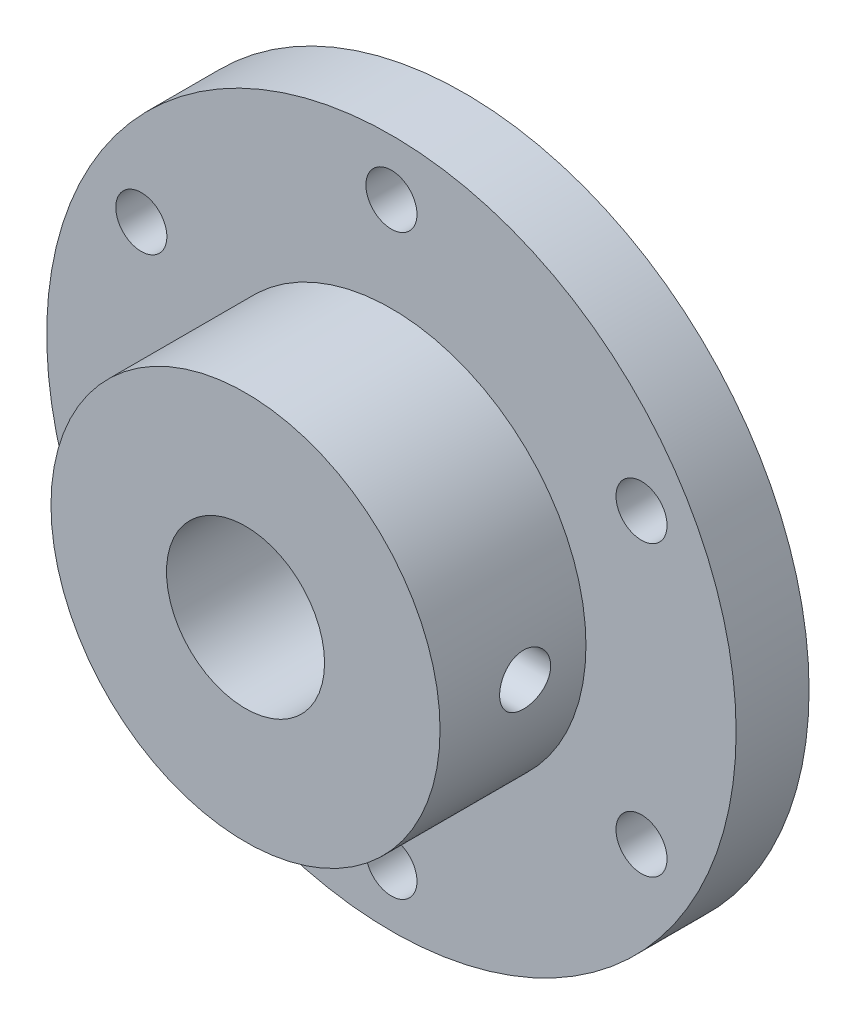
ISO-10303-21;
HEADER;
FILE_DESCRIPTION(('STEP AP214'),'2;1');
FILE_NAME('part.step','',(''),(''),'','','');
FILE_SCHEMA(('AUTOMOTIVE_DESIGN { 1 0 10303 214 1 1 1 1 }'));
ENDSEC;
DATA;
#1=APPLICATION_CONTEXT('core data for automotive mechanical design processes');
#2=APPLICATION_PROTOCOL_DEFINITION('international standard','automotive_design',2000,#1);
#3=PRODUCT_CONTEXT('',#1,'mechanical');
#4=PRODUCT('Part','Part','',(#3));
#5=PRODUCT_RELATED_PRODUCT_CATEGORY('part','',(#4));
#6=PRODUCT_DEFINITION_FORMATION('','',#4);
#7=PRODUCT_DEFINITION_CONTEXT('part definition',#1,'design');
#8=PRODUCT_DEFINITION('design','',#6,#7);
#9=PRODUCT_DEFINITION_SHAPE('','',#8);
#10=(LENGTH_UNIT() NAMED_UNIT(*) SI_UNIT(.MILLI.,.METRE.));
#11=(NAMED_UNIT(*) PLANE_ANGLE_UNIT() SI_UNIT($,.RADIAN.));
#12=(NAMED_UNIT(*) SI_UNIT($,.STERADIAN.) SOLID_ANGLE_UNIT());
#13=UNCERTAINTY_MEASURE_WITH_UNIT(LENGTH_MEASURE(1.E-05),#10,'distance_accuracy_value','');
#14=(GEOMETRIC_REPRESENTATION_CONTEXT(3) GLOBAL_UNCERTAINTY_ASSIGNED_CONTEXT((#13)) GLOBAL_UNIT_ASSIGNED_CONTEXT((#10,
#11,#12)) REPRESENTATION_CONTEXT('',''));
#15=CARTESIAN_POINT('',(0.,0.,0.));
#16=DIRECTION('',(0.,0.,1.));
#17=DIRECTION('',(1.,0.,0.));
#18=AXIS2_PLACEMENT_3D('',#15,#16,#17);
#19=CARTESIAN_POINT('',(0.,0.,6.));
#20=DIRECTION('',(0.,0.,-1.));
#21=DIRECTION('',(-1.,0.,0.));
#22=AXIS2_PLACEMENT_3D('',#19,#20,#21);
#23=CYLINDRICAL_SURFACE('',#22,28.35);
#24=CARTESIAN_POINT('',(0.,0.,6.));
#25=DIRECTION('',(0.,0.,1.));
#26=DIRECTION('',(1.,0.,0.));
#27=AXIS2_PLACEMENT_3D('',#24,#25,#26);
#28=CIRCLE('',#27,28.35);
#29=CARTESIAN_POINT('',(28.35,0.,6.));
#30=VERTEX_POINT('',#29);
#31=EDGE_CURVE('E10',#30,#30,#28,.T.);
#32=ORIENTED_EDGE('',*,*,#31,.F.);
#33=EDGE_LOOP('',(#32));
#34=FACE_BOUND('',#33,.T.);
#35=CARTESIAN_POINT('',(0.,0.,0.));
#36=DIRECTION('',(0.,0.,1.));
#37=DIRECTION('',(1.,0.,0.));
#38=AXIS2_PLACEMENT_3D('',#35,#36,#37);
#39=CIRCLE('',#38,28.35);
#40=CARTESIAN_POINT('',(28.35,0.,0.));
#41=VERTEX_POINT('',#40);
#42=EDGE_CURVE('E33',#41,#41,#39,.T.);
#43=ORIENTED_EDGE('',*,*,#42,.T.);
#44=EDGE_LOOP('',(#43));
#45=FACE_BOUND('',#44,.T.);
#46=ADVANCED_FACE('F30',(#34,#45),#23,.T.);
#47=CARTESIAN_POINT('',(0.,0.,6.));
#48=DIRECTION('',(0.,0.,1.));
#49=DIRECTION('',(1.,0.,0.));
#50=AXIS2_PLACEMENT_3D('',#47,#48,#49);
#51=PLANE('',#50);
#52=CARTESIAN_POINT('',(-20.5681033398804,-11.8750000000001,6.));
#53=DIRECTION('',(0.,0.,1.));
#54=DIRECTION('',(-0.500000000000004,0.866025403784436,0.));
#55=AXIS2_PLACEMENT_3D('',#52,#53,#54);
#56=CIRCLE('',#55,2.09999999999999);
#57=CARTESIAN_POINT('',(-21.6181033398804,-10.0563466520528,6.));
#58=VERTEX_POINT('',#57);
#59=EDGE_CURVE('E83',#58,#58,#56,.T.);
#60=ORIENTED_EDGE('',*,*,#59,.F.);
#61=EDGE_LOOP('',(#60));
#62=FACE_BOUND('',#61,.T.);
#63=CARTESIAN_POINT('',(0.,-23.75,6.));
#64=DIRECTION('',(0.,0.,1.));
#65=DIRECTION('',(-1.,0.,0.));
#66=AXIS2_PLACEMENT_3D('',#63,#64,#65);
#67=CIRCLE('',#66,2.09999999999999);
#68=CARTESIAN_POINT('',(-2.09999999999999,-23.75,6.));
#69=VERTEX_POINT('',#68);
#70=EDGE_CURVE('E77',#69,#69,#67,.T.);
#71=ORIENTED_EDGE('',*,*,#70,.F.);
#72=EDGE_LOOP('',(#71));
#73=FACE_BOUND('',#72,.T.);
#74=CARTESIAN_POINT('',(20.5681033398805,-11.8749999999998,6.));
#75=DIRECTION('',(0.,0.,1.));
#76=DIRECTION('',(-0.499999999999992,-0.866025403784443,0.));
#77=AXIS2_PLACEMENT_3D('',#74,#75,#76);
#78=CIRCLE('',#77,2.09999999999999);
#79=CARTESIAN_POINT('',(19.5181033398806,-13.6936533479471,6.));
#80=VERTEX_POINT('',#79);
#81=EDGE_CURVE('E69',#80,#80,#78,.T.);
#82=ORIENTED_EDGE('',*,*,#81,.F.);
#83=EDGE_LOOP('',(#82));
#84=FACE_BOUND('',#83,.T.);
#85=CARTESIAN_POINT('',(20.5681033398803,11.8750000000002,6.));
#86=DIRECTION('',(0.,0.,1.));
#87=DIRECTION('',(0.50000000000001,-0.866025403784433,0.));
#88=AXIS2_PLACEMENT_3D('',#85,#86,#87);
#89=CIRCLE('',#88,2.09999999999999);
#90=CARTESIAN_POINT('',(21.6181033398803,10.0563466520529,6.));
#91=VERTEX_POINT('',#90);
#92=EDGE_CURVE('E70',#91,#91,#89,.T.);
#93=ORIENTED_EDGE('',*,*,#92,.F.);
#94=EDGE_LOOP('',(#93));
#95=FACE_BOUND('',#94,.T.);
#96=CARTESIAN_POINT('',(-20.5681033398804,11.875,6.));
#97=DIRECTION('',(0.,0.,1.));
#98=DIRECTION('',(0.499999999999998,0.86602540378444,0.));
#99=AXIS2_PLACEMENT_3D('',#96,#97,#98);
#100=CIRCLE('',#99,2.09999999999999);
#101=CARTESIAN_POINT('',(-19.5181033398805,13.6936533479473,6.));
#102=VERTEX_POINT('',#101);
#103=EDGE_CURVE('E62',#102,#102,#100,.T.);
#104=ORIENTED_EDGE('',*,*,#103,.F.);
#105=EDGE_LOOP('',(#104));
#106=FACE_BOUND('',#105,.T.);
#107=CARTESIAN_POINT('',(0.,23.75,6.));
#108=DIRECTION('',(0.,0.,1.));
#109=DIRECTION('',(1.,0.,0.));
#110=AXIS2_PLACEMENT_3D('',#107,#108,#109);
#111=CIRCLE('',#110,2.09999999999999);
#112=CARTESIAN_POINT('',(2.09999999999999,23.75,6.));
#113=VERTEX_POINT('',#112);
#114=EDGE_CURVE('E51',#113,#113,#111,.T.);
#115=ORIENTED_EDGE('',*,*,#114,.F.);
#116=EDGE_LOOP('',(#115));
#117=FACE_BOUND('',#116,.T.);
#118=CARTESIAN_POINT('',(0.,0.,6.));
#119=DIRECTION('',(0.,0.,1.));
#120=DIRECTION('',(1.,0.,0.));
#121=AXIS2_PLACEMENT_3D('',#118,#119,#120);
#122=CIRCLE('',#121,16.);
#123=CARTESIAN_POINT('',(16.,0.,6.));
#124=VERTEX_POINT('',#123);
#125=EDGE_CURVE('E42',#124,#124,#122,.T.);
#126=ORIENTED_EDGE('',*,*,#125,.F.);
#127=EDGE_LOOP('',(#126));
#128=FACE_BOUND('',#127,.T.);
#129=ORIENTED_EDGE('',*,*,#31,.T.);
#130=EDGE_LOOP('',(#129));
#131=FACE_BOUND('',#130,.T.);
#132=ADVANCED_FACE('F141',(#62,#73,#84,#95,#106,#117,#128,#131),#51,.T.);
#133=CARTESIAN_POINT('',(0.,0.,0.));
#134=DIRECTION('',(0.,0.,1.));
#135=DIRECTION('',(1.,0.,0.));
#136=AXIS2_PLACEMENT_3D('',#133,#134,#135);
#137=PLANE('',#136);
#138=CARTESIAN_POINT('',(-20.5681033398804,-11.8750000000001,0.));
#139=DIRECTION('',(0.,0.,-1.));
#140=DIRECTION('',(0.500000000000004,-0.866025403784436,0.));
#141=AXIS2_PLACEMENT_3D('',#138,#139,#140);
#142=CIRCLE('',#141,2.09999999999999);
#143=CARTESIAN_POINT('',(-19.5181033398804,-13.6936533479474,0.));
#144=VERTEX_POINT('',#143);
#145=EDGE_CURVE('E65',#144,#144,#142,.T.);
#146=ORIENTED_EDGE('',*,*,#145,.F.);
#147=EDGE_LOOP('',(#146));
#148=FACE_BOUND('',#147,.T.);
#149=CARTESIAN_POINT('',(0.,-23.75,0.));
#150=DIRECTION('',(0.,0.,-1.));
#151=DIRECTION('',(1.,0.,0.));
#152=AXIS2_PLACEMENT_3D('',#149,#150,#151);
#153=CIRCLE('',#152,2.09999999999999);
#154=CARTESIAN_POINT('',(2.09999999999999,-23.75,0.));
#155=VERTEX_POINT('',#154);
#156=EDGE_CURVE('E80',#155,#155,#153,.T.);
#157=ORIENTED_EDGE('',*,*,#156,.F.);
#158=EDGE_LOOP('',(#157));
#159=FACE_BOUND('',#158,.T.);
#160=CARTESIAN_POINT('',(20.5681033398805,-11.8749999999998,0.));
#161=DIRECTION('',(0.,0.,-1.));
#162=DIRECTION('',(0.499999999999992,0.866025403784443,0.));
#163=AXIS2_PLACEMENT_3D('',#160,#161,#162);
#164=CIRCLE('',#163,2.09999999999999);
#165=CARTESIAN_POINT('',(21.6181033398805,-10.0563466520525,0.));
#166=VERTEX_POINT('',#165);
#167=EDGE_CURVE('E74',#166,#166,#164,.T.);
#168=ORIENTED_EDGE('',*,*,#167,.F.);
#169=EDGE_LOOP('',(#168));
#170=FACE_BOUND('',#169,.T.);
#171=CARTESIAN_POINT('',(20.5681033398803,11.8750000000002,0.));
#172=DIRECTION('',(0.,0.,-1.));
#173=DIRECTION('',(-0.50000000000001,0.866025403784433,0.));
#174=AXIS2_PLACEMENT_3D('',#171,#172,#173);
#175=CIRCLE('',#174,2.09999999999999);
#176=CARTESIAN_POINT('',(19.5181033398803,13.6936533479475,0.));
#177=VERTEX_POINT('',#176);
#178=EDGE_CURVE('E66',#177,#177,#175,.T.);
#179=ORIENTED_EDGE('',*,*,#178,.F.);
#180=EDGE_LOOP('',(#179));
#181=FACE_BOUND('',#180,.T.);
#182=CARTESIAN_POINT('',(-20.5681033398804,11.875,0.));
#183=DIRECTION('',(0.,0.,-1.));
#184=DIRECTION('',(-0.499999999999998,-0.86602540378444,0.));
#185=AXIS2_PLACEMENT_3D('',#182,#183,#184);
#186=CIRCLE('',#185,2.09999999999999);
#187=CARTESIAN_POINT('',(-21.6181033398804,10.0563466520526,0.));
#188=VERTEX_POINT('',#187);
#189=EDGE_CURVE('E59',#188,#188,#186,.T.);
#190=ORIENTED_EDGE('',*,*,#189,.F.);
#191=EDGE_LOOP('',(#190));
#192=FACE_BOUND('',#191,.T.);
#193=CARTESIAN_POINT('',(0.,23.75,0.));
#194=DIRECTION('',(0.,0.,-1.));
#195=DIRECTION('',(-1.,0.,0.));
#196=AXIS2_PLACEMENT_3D('',#193,#194,#195);
#197=CIRCLE('',#196,2.09999999999999);
#198=CARTESIAN_POINT('',(-2.09999999999999,23.75,0.));
#199=VERTEX_POINT('',#198);
#200=EDGE_CURVE('E56',#199,#199,#197,.T.);
#201=ORIENTED_EDGE('',*,*,#200,.F.);
#202=EDGE_LOOP('',(#201));
#203=FACE_BOUND('',#202,.T.);
#204=CARTESIAN_POINT('',(0.,0.,0.));
#205=DIRECTION('',(0.,0.,1.));
#206=DIRECTION('',(1.,0.,0.));
#207=AXIS2_PLACEMENT_3D('',#204,#205,#206);
#208=CIRCLE('',#207,6.5);
#209=CARTESIAN_POINT('',(6.5,0.,0.));
#210=VERTEX_POINT('',#209);
#211=EDGE_CURVE('E45',#210,#210,#208,.T.);
#212=ORIENTED_EDGE('',*,*,#211,.T.);
#213=EDGE_LOOP('',(#212));
#214=FACE_BOUND('',#213,.T.);
#215=ORIENTED_EDGE('',*,*,#42,.F.);
#216=EDGE_LOOP('',(#215));
#217=FACE_BOUND('',#216,.T.);
#218=ADVANCED_FACE('F139',(#148,#159,#170,#181,#192,#203,#214,#217),#137,.F.);
#219=CARTESIAN_POINT('',(0.,0.,18.));
#220=DIRECTION('',(0.,0.,-1.));
#221=DIRECTION('',(-1.,0.,0.));
#222=AXIS2_PLACEMENT_3D('',#219,#220,#221);
#223=CYLINDRICAL_SURFACE('',#222,16.);
#224=CARTESIAN_POINT('',(16.,0.,8.9));
#225=CARTESIAN_POINT('',(15.9999982962631,0.117416484353102,8.90000495705236));
#226=CARTESIAN_POINT('',(15.9986938773925,0.234905122011887,8.90988080691643));
#227=CARTESIAN_POINT('',(15.9936157778764,0.466609665583491,8.94911967052718));
#228=CARTESIAN_POINT('',(15.9898395595276,0.580822081998048,8.97850271201433));
#229=CARTESIAN_POINT('',(15.9802430281394,0.802586512568987,9.0558724099226));
#230=CARTESIAN_POINT('',(15.9744241309754,0.910143079615394,9.10384618263218));
#231=CARTESIAN_POINT('',(15.9613884397463,1.1156593399402,9.21700655797674));
#232=CARTESIAN_POINT('',(15.9541718747973,1.21362060219517,9.28219034005324));
#233=CARTESIAN_POINT('',(15.9390970395828,1.39777717587375,9.4283413083698));
#234=CARTESIAN_POINT('',(15.9312355150333,1.48390610575507,9.50939181113075));
#235=CARTESIAN_POINT('',(15.9157828604001,1.64138117851605,9.68479647193949));
#236=CARTESIAN_POINT('',(15.908191744508,1.71272654645484,9.77915132695387));
#237=CARTESIAN_POINT('',(15.8941075163014,1.83885928171324,9.9789213126258));
#238=CARTESIAN_POINT('',(15.8876186009931,1.89358395666576,10.0843763480338));
#239=CARTESIAN_POINT('',(15.8765168113299,1.98452144739535,10.3030795517579));
#240=CARTESIAN_POINT('',(15.8719038586674,2.02073503589053,10.4163273945506));
#241=CARTESIAN_POINT('',(15.8651076274545,2.0734195616491,10.6467101739999));
#242=CARTESIAN_POINT('',(15.8629105101852,2.0900029894288,10.7638189706013));
#243=CARTESIAN_POINT('',(15.8611524584727,2.10330463008907,10.9991763708029));
#244=CARTESIAN_POINT('',(15.8615914075016,2.10002372107694,11.1174249237892));
#245=CARTESIAN_POINT('',(15.8650432287045,2.07378206445453,11.3509187553438));
#246=CARTESIAN_POINT('',(15.86803985239,2.05094554741099,11.4661782702577));
#247=CARTESIAN_POINT('',(15.8762440291591,1.98643489899058,11.6912149779756));
#248=CARTESIAN_POINT('',(15.8814516312202,1.94476035031288,11.8009920492725));
#249=CARTESIAN_POINT('',(15.8935093147413,1.84362411100889,12.0123317781193));
#250=CARTESIAN_POINT('',(15.9003643391794,1.78410875473803,12.1138684605443));
#251=CARTESIAN_POINT('',(15.9149407211294,1.64901867206017,12.3055604124573));
#252=CARTESIAN_POINT('',(15.9226621222936,1.57344313629226,12.395715107979));
#253=CARTESIAN_POINT('',(15.9381733835384,1.40769104741128,12.5628047526722));
#254=CARTESIAN_POINT('',(15.9459633163989,1.31740747591083,12.6396335731953));
#255=CARTESIAN_POINT('',(15.9606788849759,1.12516973659487,12.7770631591691));
#256=CARTESIAN_POINT('',(15.9676045183355,1.02321553695397,12.8376638803649));
#257=CARTESIAN_POINT('',(15.9798160936183,0.81044643682083,12.9409183626589));
#258=CARTESIAN_POINT('',(15.9851013953531,0.699628098002016,12.9835651189946));
#259=CARTESIAN_POINT('',(15.9934311173904,0.472318289200564,13.0496149743927));
#260=CARTESIAN_POINT('',(15.9964756534268,0.355827112547463,13.0730190673325));
#261=CARTESIAN_POINT('',(15.9999656992249,0.12139562938738,13.0997808566157));
#262=CARTESIAN_POINT('',(16.0004301540478,0.00347227541262437,13.103284681241));
#263=CARTESIAN_POINT('',(15.9987589549612,-0.231280014343777,13.0905326292899));
#264=CARTESIAN_POINT('',(15.9966233622396,-0.348108975814989,13.0742772177153));
#265=CARTESIAN_POINT('',(15.990003800972,-0.57692228410594,13.0225895536893));
#266=CARTESIAN_POINT('',(15.9855284102365,-0.688922719796447,12.9872273319612));
#267=CARTESIAN_POINT('',(15.974730073111,-0.905403997412976,12.8984029024912));
#268=CARTESIAN_POINT('',(15.9684070581947,-1.00988456025589,12.8449400234038));
#269=CARTESIAN_POINT('',(15.9545706371482,-1.2090105555854,12.721080854769));
#270=CARTESIAN_POINT('',(15.947050698098,-1.30359699513709,12.6505904659569));
#271=CARTESIAN_POINT('',(15.9316811346644,-1.47964872574463,12.4948098674338));
#272=CARTESIAN_POINT('',(15.9238314958089,-1.56111344006267,12.4095190075414));
#273=CARTESIAN_POINT('',(15.9086283992346,-1.70913080865221,12.2259132317372));
#274=CARTESIAN_POINT('',(15.9012783770394,-1.77558633636806,12.1275196890213));
#275=CARTESIAN_POINT('',(15.8879642527691,-1.89102695628024,11.9208813855286));
#276=CARTESIAN_POINT('',(15.8820001205454,-1.94001242853153,11.8126368391213));
#277=CARTESIAN_POINT('',(15.8721568354206,-2.01896672841903,11.5896770175875));
#278=CARTESIAN_POINT('',(15.8682717771357,-2.04898946191644,11.4749811034711));
#279=CARTESIAN_POINT('',(15.8630098837321,-2.08933920892608,11.242121268751));
#280=CARTESIAN_POINT('',(15.8616329189455,-2.09966724065019,11.1239575277539));
#281=CARTESIAN_POINT('',(15.8615471546198,-2.10031443069061,10.8884829294453));
#282=CARTESIAN_POINT('',(15.8628180045269,-2.09078619999575,10.7711724699154));
#283=CARTESIAN_POINT('',(15.8678408142836,-2.05231540968838,10.5398362007954));
#284=CARTESIAN_POINT('',(15.8715927735212,-2.02337285486407,10.4258103903953));
#285=CARTESIAN_POINT('',(15.8811485642185,-1.94694420408523,10.2043055075203));
#286=CARTESIAN_POINT('',(15.8869514953252,-1.89946624400469,10.096823586585));
#287=CARTESIAN_POINT('',(15.8999567709492,-1.78732950445978,9.89132723687448));
#288=CARTESIAN_POINT('',(15.9071591400699,-1.7226704229297,9.79331297459389));
#289=CARTESIAN_POINT('',(15.9222180092564,-1.57744326503153,9.60875508025564));
#290=CARTESIAN_POINT('',(15.9300789344295,-1.49676157774286,9.52230120152492));
#291=CARTESIAN_POINT('',(15.9455305998353,-1.32201773458277,9.36410229468749));
#292=CARTESIAN_POINT('',(15.9531212761728,-1.22795244033518,9.29236072619036));
#293=CARTESIAN_POINT('',(15.9672126278133,-1.02865642383035,9.16536363306548));
#294=CARTESIAN_POINT('',(15.9737086069784,-0.923380607893781,9.11017838182219));
#295=CARTESIAN_POINT('',(15.9848315489309,-0.705026961411323,9.01835047192647));
#296=CARTESIAN_POINT('',(15.9894605194548,-0.591957665878867,8.98168788366503));
#297=CARTESIAN_POINT('',(15.9952257223333,-0.398600577498265,8.93661582244385));
#298=CARTESIAN_POINT('',(15.9970072452264,-0.319526543474694,8.92290490974843));
#299=CARTESIAN_POINT('',(15.9993949607654,-0.160312880332424,8.90459534461191));
#300=CARTESIAN_POINT('',(16.0000011633302,-0.0801732602122652,8.89999661527041));
#301=CARTESIAN_POINT('',(16.,0.,8.9));
#302=B_SPLINE_CURVE_WITH_KNOTS('',3,(#224,#225,#226,#227,#228,#229,#230,#231,#232,#233,#234,
#235,#236,#237,#238,#239,#240,#241,#242,#243,#244,#245,#246,#247,#248,#249,#250,#251,#252,#253,
#254,#255,#256,#257,#258,#259,#260,#261,#262,#263,#264,#265,#266,#267,#268,#269,#270,#271,#272,
#273,#274,#275,#276,#277,#278,#279,#280,#281,#282,#283,#284,#285,#286,#287,#288,#289,#290,#291,
#292,#293,#294,#295,#296,#297,#298,#299,#300,#301),.UNSPECIFIED.,.T.,.F.,(4,2,2,2,2,2,2,2,2,2,2,
2,2,2,2,2,2,2,2,2,2,2,2,2,2,2,2,2,2,2,2,2,2,2,2,2,2,2,4),(0.,0.351956579597512,
0.704275067694988,1.05634982812868,1.40836692260358,1.76228460352201,2.11622083179281,
2.47147596652804,2.82671627044793,3.17991086217002,3.53308984096312,3.88404169036012,
4.2350013144372,4.58702741286475,4.9390712560353,5.29380151830567,5.64853274793558,
6.00340224843457,6.35825341888271,6.71049550361346,7.06272929905446,7.41368075090289,
7.76464522081314,8.11759548065947,8.47056124946069,8.82574953425382,9.18093009157842,
9.53509636913481,9.88924433587379,10.2406804386663,10.5921164547833,10.9433983857755,
11.2946864931543,11.6485606276522,12.0025178807118,12.3579569170413,12.7130126970205,
12.9533345286082,13.1936543320409),.UNSPECIFIED.);
#303=CARTESIAN_POINT('',(16.,0.,8.9));
#304=VERTEX_POINT('',#303);
#305=EDGE_CURVE('E73',#304,#304,#302,.T.);
#306=ORIENTED_EDGE('',*,*,#305,.F.);
#307=EDGE_LOOP('',(#306));
#308=FACE_BOUND('',#307,.T.);
#309=CARTESIAN_POINT('',(0.,0.,18.));
#310=DIRECTION('',(0.,0.,1.));
#311=DIRECTION('',(1.,0.,0.));
#312=AXIS2_PLACEMENT_3D('',#309,#310,#311);
#313=CIRCLE('',#312,16.);
#314=CARTESIAN_POINT('',(16.,0.,18.));
#315=VERTEX_POINT('',#314);
#316=EDGE_CURVE('E40',#315,#315,#313,.T.);
#317=ORIENTED_EDGE('',*,*,#316,.F.);
#318=EDGE_LOOP('',(#317));
#319=FACE_BOUND('',#318,.T.);
#320=ORIENTED_EDGE('',*,*,#125,.T.);
#321=EDGE_LOOP('',(#320));
#322=FACE_BOUND('',#321,.T.);
#323=ADVANCED_FACE('F135',(#308,#319,#322),#223,.T.);
#324=CARTESIAN_POINT('',(0.,0.,18.));
#325=DIRECTION('',(0.,0.,1.));
#326=DIRECTION('',(1.,0.,0.));
#327=AXIS2_PLACEMENT_3D('',#324,#325,#326);
#328=PLANE('',#327);
#329=CARTESIAN_POINT('',(0.,0.,18.));
#330=DIRECTION('',(0.,0.,1.));
#331=DIRECTION('',(1.,0.,0.));
#332=AXIS2_PLACEMENT_3D('',#329,#330,#331);
#333=CIRCLE('',#332,6.5);
#334=CARTESIAN_POINT('',(6.5,0.,18.));
#335=VERTEX_POINT('',#334);
#336=EDGE_CURVE('E48',#335,#335,#333,.T.);
#337=ORIENTED_EDGE('',*,*,#336,.F.);
#338=EDGE_LOOP('',(#337));
#339=FACE_BOUND('',#338,.T.);
#340=ORIENTED_EDGE('',*,*,#316,.T.);
#341=EDGE_LOOP('',(#340));
#342=FACE_BOUND('',#341,.T.);
#343=ADVANCED_FACE('F131',(#339,#342),#328,.T.);
#344=CARTESIAN_POINT('',(0.,0.,0.));
#345=DIRECTION('',(0.,0.,1.));
#346=DIRECTION('',(1.,0.,0.));
#347=AXIS2_PLACEMENT_3D('',#344,#345,#346);
#348=CYLINDRICAL_SURFACE('',#347,6.5);
#349=CARTESIAN_POINT('',(6.5,0.,8.9));
#350=CARTESIAN_POINT('',(6.49999984762594,-0.11478015267852,8.90000013326097));
#351=CARTESIAN_POINT('',(6.49693136614676,-0.229562646212126,8.90944116425099));
#352=CARTESIAN_POINT('',(6.48499201245018,-0.455758735968136,8.94684858951265));
#353=CARTESIAN_POINT('',(6.47612018587026,-0.567171774928909,8.97481803079873));
#354=CARTESIAN_POINT('',(6.45354073761235,-0.783334943692378,9.04823192886978));
#355=CARTESIAN_POINT('',(6.43984090576822,-0.888095487627853,9.09364824624092));
#356=CARTESIAN_POINT('',(6.40901183916854,-1.08851351392821,9.20054322424069));
#357=CARTESIAN_POINT('',(6.39188199424108,-1.18416937216913,9.2620247433346));
#358=CARTESIAN_POINT('',(6.35537555243329,-1.36679767568749,9.40142339988139));
#359=CARTESIAN_POINT('',(6.33594753880125,-1.45343019593023,9.47977234832067));
#360=CARTESIAN_POINT('',(6.29732467015338,-1.61258241008024,9.64976310716213));
#361=CARTESIAN_POINT('',(6.27812986315358,-1.6850992423096,9.74140760641673));
#362=CARTESIAN_POINT('',(6.24158803844324,-1.81585313888028,9.93838942073292));
#363=CARTESIAN_POINT('',(6.22430408492323,-1.87365695616513,10.0440271375786));
#364=CARTESIAN_POINT('',(6.19431848653863,-1.97053521369596,10.2641730612946));
#365=CARTESIAN_POINT('',(6.18161553983706,-2.00961497600927,10.3786787368016));
#366=CARTESIAN_POINT('',(6.16276983931889,-2.06667622660958,10.6094591201013));
#367=CARTESIAN_POINT('',(6.15643057256345,-2.0852915301278,10.7255606061229));
#368=CARTESIAN_POINT('',(6.15044761140108,-2.10287625070446,10.9593986910689));
#369=CARTESIAN_POINT('',(6.15080199454799,-2.101851308528,11.0771348108124));
#370=CARTESIAN_POINT('',(6.15799345504348,-2.08067854494973,11.3055768377815));
#371=CARTESIAN_POINT('',(6.16455379741828,-2.06134700904493,11.4163686019231));
#372=CARTESIAN_POINT('',(6.18296679592779,-2.00543737492302,11.6330430309594));
#373=CARTESIAN_POINT('',(6.1948200499337,-1.96885732834052,11.7389251397825));
#374=CARTESIAN_POINT('',(6.22268788340782,-1.87893383724714,11.94467403774));
#375=CARTESIAN_POINT('',(6.23876362994827,-1.82534134925149,12.0444233394089));
#376=CARTESIAN_POINT('',(6.2732382947439,-1.70308717246323,12.2337759870639));
#377=CARTESIAN_POINT('',(6.29163785022376,-1.6344213464996,12.3233765372721));
#378=CARTESIAN_POINT('',(6.32978643852367,-1.48000669369173,12.4944892936782));
#379=CARTESIAN_POINT('',(6.34955748594388,-1.39358721886844,12.5753925649043));
#380=CARTESIAN_POINT('',(6.38743186866717,-1.20816261133916,12.7217118952384));
#381=CARTESIAN_POINT('',(6.40553506275021,-1.10915641457954,12.7871266436411));
#382=CARTESIAN_POINT('',(6.43824721057395,-0.900136372310454,12.9010630861593));
#383=CARTESIAN_POINT('',(6.45282391669772,-0.790033092396686,12.9494305995234));
#384=CARTESIAN_POINT('',(6.47660732137455,-0.562670821437449,13.0267726307963));
#385=CARTESIAN_POINT('',(6.48581576747844,-0.4454141728024,13.0557534601823));
#386=CARTESIAN_POINT('',(6.49753974554395,-0.2122355686941,13.0924414490988));
#387=CARTESIAN_POINT('',(6.50031423039758,-0.0964560310383877,13.1009721849127));
#388=CARTESIAN_POINT('',(6.49962893282386,0.134897611158433,13.0988518883504));
#389=CARTESIAN_POINT('',(6.49617013124436,0.250471745156622,13.0882038738745));
#390=CARTESIAN_POINT('',(6.48357748396053,0.474897398486163,13.0486849183147));
#391=CARTESIAN_POINT('',(6.47459876244501,0.583846122334336,13.0203117592815));
#392=CARTESIAN_POINT('',(6.4520280403984,0.795399868811156,12.9467627922165));
#393=CARTESIAN_POINT('',(6.43843545964271,0.898004091655654,12.9015848708016));
#394=CARTESIAN_POINT('',(6.40759659592119,1.09685611026068,12.7944320236055));
#395=CARTESIAN_POINT('',(6.39026632979125,1.19287645758089,12.7320598528519));
#396=CARTESIAN_POINT('',(6.35392571159687,1.37335993471932,12.5927605608013));
#397=CARTESIAN_POINT('',(6.33491487544933,1.45781971658139,12.5158292384573));
#398=CARTESIAN_POINT('',(6.29633442103443,1.61651818338125,12.3457209755327));
#399=CARTESIAN_POINT('',(6.27677542522803,1.69016938349652,12.2519922563222));
#400=CARTESIAN_POINT('',(6.24014795835414,1.82076055180556,12.053082794392));
#401=CARTESIAN_POINT('',(6.22307947542276,1.87770059960644,11.9479021062294));
#402=CARTESIAN_POINT('',(6.19354517835395,1.97293988416012,11.7291691602628));
#403=CARTESIAN_POINT('',(6.18106547836716,2.0112954720899,11.6156434271912));
#404=CARTESIAN_POINT('',(6.16226449334382,2.06819042623144,11.3832533722931));
#405=CARTESIAN_POINT('',(6.15594065306915,2.08673801486373,11.2643912869866));
#406=CARTESIAN_POINT('',(6.15044597744328,2.10287398644436,11.0308786474295));
#407=CARTESIAN_POINT('',(6.1509443099754,2.1014317073017,10.9163020737839));
#408=CARTESIAN_POINT('',(6.15822697913326,2.07999175555092,10.6891122898019));
#409=CARTESIAN_POINT('',(6.1650109834417,2.05999506389632,10.5764989759905));
#410=CARTESIAN_POINT('',(6.18386170119516,2.0026819067383,10.3582971845668));
#411=CARTESIAN_POINT('',(6.19583805979404,1.96566104718839,10.2526226560169));
#412=CARTESIAN_POINT('',(6.22369569223963,1.87558632651302,10.0489019638837));
#413=CARTESIAN_POINT('',(6.23957779800492,1.82252904910129,9.95085743134324));
#414=CARTESIAN_POINT('',(6.27427773405697,1.69932067816035,9.7607816701388));
#415=CARTESIAN_POINT('',(6.29318990404038,1.62855266631233,9.66916762849268));
#416=CARTESIAN_POINT('',(6.33140503172638,1.47299576999185,9.49880177489966));
#417=CARTESIAN_POINT('',(6.35070809559453,1.38820303038323,9.42005351137916));
#418=CARTESIAN_POINT('',(6.38835851966061,1.20335860583316,9.27482546498718));
#419=CARTESIAN_POINT('',(6.40664701425018,1.10286967112843,9.20888514525647));
#420=CARTESIAN_POINT('',(6.43943829822981,0.891645850173484,9.09491304176281));
#421=CARTESIAN_POINT('',(6.45394231934155,0.780914313486271,9.04687542907176));
#422=CARTESIAN_POINT('',(6.4767469097158,0.559731443724438,8.97283194592696));
#423=CARTESIAN_POINT('',(6.48538779223929,0.449724427071784,8.94560293582374));
#424=CARTESIAN_POINT('',(6.49701374152978,0.226478517537958,8.90918903792171));
#425=CARTESIAN_POINT('',(6.50000015032999,0.113240398005008,8.89999986852671));
#426=CARTESIAN_POINT('',(6.5,0.,8.9));
#427=B_SPLINE_CURVE_WITH_KNOTS('',3,(#349,#350,#351,#352,#353,#354,#355,#356,#357,#358,#359,
#360,#361,#362,#363,#364,#365,#366,#367,#368,#369,#370,#371,#372,#373,#374,#375,#376,#377,#378,
#379,#380,#381,#382,#383,#384,#385,#386,#387,#388,#389,#390,#391,#392,#393,#394,#395,#396,#397,
#398,#399,#400,#401,#402,#403,#404,#405,#406,#407,#408,#409,#410,#411,#412,#413,#414,#415,#416,
#417,#418,#419,#420,#421,#422,#423,#424,#425,#426),.UNSPECIFIED.,.T.,.F.,(4,2,2,2,2,2,2,2,2,2,2,
2,2,2,2,2,2,2,2,2,2,2,2,2,2,2,2,2,2,2,2,2,2,2,2,2,2,2,4),(0.,0.343923981095444,
0.687904534857075,1.0313326088658,1.37482183034691,1.72845644393134,2.08216267547618,
2.4453183332506,2.80837070746089,3.15983101194152,3.51119037698753,3.84758565907629,
4.18401894896814,4.52562389865709,4.86732272596724,5.22571361317307,5.58413481812311,
5.94571918962466,6.30718578731836,6.65383086592771,7.00042140245966,7.33769086053154,
7.67500274828454,8.02087649799565,8.36685020225929,8.72753837967963,9.08822483885801,
9.44781068404835,9.80724720488736,10.1493177330619,10.4913701773347,10.8276953457348,
11.1640922130562,11.5144204767655,11.8648451997129,12.2278019086183,12.5906403392817,
12.9300312044731,13.2693415085097),.UNSPECIFIED.);
#428=CARTESIAN_POINT('',(6.5,0.,8.9));
#429=VERTEX_POINT('',#428);
#430=EDGE_CURVE('E96',#429,#429,#427,.T.);
#431=ORIENTED_EDGE('',*,*,#430,.F.);
#432=EDGE_LOOP('',(#431));
#433=FACE_BOUND('',#432,.T.);
#434=ORIENTED_EDGE('',*,*,#211,.F.);
#435=EDGE_LOOP('',(#434));
#436=FACE_BOUND('',#435,.T.);
#437=ORIENTED_EDGE('',*,*,#336,.T.);
#438=EDGE_LOOP('',(#437));
#439=FACE_BOUND('',#438,.T.);
#440=ADVANCED_FACE('F127',(#433,#436,#439),#348,.F.);
#441=CARTESIAN_POINT('',(0.,23.75,0.));
#442=DIRECTION('',(0.,0.,-1.));
#443=DIRECTION('',(-1.,0.,0.));
#444=AXIS2_PLACEMENT_3D('',#441,#442,#443);
#445=CYLINDRICAL_SURFACE('',#444,2.09999999999999);
#446=ORIENTED_EDGE('',*,*,#114,.T.);
#447=EDGE_LOOP('',(#446));
#448=FACE_BOUND('',#447,.T.);
#449=ORIENTED_EDGE('',*,*,#200,.T.);
#450=EDGE_LOOP('',(#449));
#451=FACE_BOUND('',#450,.T.);
#452=ADVANCED_FACE('F123',(#448,#451),#445,.F.);
#453=CARTESIAN_POINT('',(-20.5681033398804,11.875,0.));
#454=DIRECTION('',(0.,0.,-1.));
#455=DIRECTION('',(-0.499999999999998,-0.86602540378444,0.));
#456=AXIS2_PLACEMENT_3D('',#453,#454,#455);
#457=CYLINDRICAL_SURFACE('',#456,2.09999999999999);
#458=ORIENTED_EDGE('',*,*,#103,.T.);
#459=EDGE_LOOP('',(#458));
#460=FACE_BOUND('',#459,.T.);
#461=ORIENTED_EDGE('',*,*,#189,.T.);
#462=EDGE_LOOP('',(#461));
#463=FACE_BOUND('',#462,.T.);
#464=ADVANCED_FACE('F119',(#460,#463),#457,.F.);
#465=CARTESIAN_POINT('',(20.5681033398803,11.8750000000002,0.));
#466=DIRECTION('',(0.,0.,-1.));
#467=DIRECTION('',(-0.50000000000001,0.866025403784433,0.));
#468=AXIS2_PLACEMENT_3D('',#465,#466,#467);
#469=CYLINDRICAL_SURFACE('',#468,2.09999999999999);
#470=ORIENTED_EDGE('',*,*,#92,.T.);
#471=EDGE_LOOP('',(#470));
#472=FACE_BOUND('',#471,.T.);
#473=ORIENTED_EDGE('',*,*,#178,.T.);
#474=EDGE_LOOP('',(#473));
#475=FACE_BOUND('',#474,.T.);
#476=ADVANCED_FACE('F115',(#472,#475),#469,.F.);
#477=CARTESIAN_POINT('',(20.5681033398805,-11.8749999999998,0.));
#478=DIRECTION('',(0.,0.,-1.));
#479=DIRECTION('',(0.499999999999992,0.866025403784443,0.));
#480=AXIS2_PLACEMENT_3D('',#477,#478,#479);
#481=CYLINDRICAL_SURFACE('',#480,2.09999999999999);
#482=ORIENTED_EDGE('',*,*,#81,.T.);
#483=EDGE_LOOP('',(#482));
#484=FACE_BOUND('',#483,.T.);
#485=ORIENTED_EDGE('',*,*,#167,.T.);
#486=EDGE_LOOP('',(#485));
#487=FACE_BOUND('',#486,.T.);
#488=ADVANCED_FACE('F111',(#484,#487),#481,.F.);
#489=CARTESIAN_POINT('',(0.,-23.75,0.));
#490=DIRECTION('',(0.,0.,-1.));
#491=DIRECTION('',(1.,0.,0.));
#492=AXIS2_PLACEMENT_3D('',#489,#490,#491);
#493=CYLINDRICAL_SURFACE('',#492,2.09999999999999);
#494=ORIENTED_EDGE('',*,*,#70,.T.);
#495=EDGE_LOOP('',(#494));
#496=FACE_BOUND('',#495,.T.);
#497=ORIENTED_EDGE('',*,*,#156,.T.);
#498=EDGE_LOOP('',(#497));
#499=FACE_BOUND('',#498,.T.);
#500=ADVANCED_FACE('F107',(#496,#499),#493,.F.);
#501=CARTESIAN_POINT('',(-20.5681033398804,-11.8750000000001,0.));
#502=DIRECTION('',(0.,0.,-1.));
#503=DIRECTION('',(0.500000000000004,-0.866025403784436,0.));
#504=AXIS2_PLACEMENT_3D('',#501,#502,#503);
#505=CYLINDRICAL_SURFACE('',#504,2.09999999999999);
#506=ORIENTED_EDGE('',*,*,#59,.T.);
#507=EDGE_LOOP('',(#506));
#508=FACE_BOUND('',#507,.T.);
#509=ORIENTED_EDGE('',*,*,#145,.T.);
#510=EDGE_LOOP('',(#509));
#511=FACE_BOUND('',#510,.T.);
#512=ADVANCED_FACE('F104',(#508,#511),#505,.F.);
#513=CARTESIAN_POINT('',(-28.351,0.,11.));
#514=DIRECTION('',(1.,0.,0.));
#515=DIRECTION('',(0.,0.,-1.));
#516=AXIS2_PLACEMENT_3D('',#513,#514,#515);
#517=CYLINDRICAL_SURFACE('',#516,2.1);
#518=ORIENTED_EDGE('',*,*,#430,.T.);
#519=EDGE_LOOP('',(#518));
#520=FACE_BOUND('',#519,.T.);
#521=ORIENTED_EDGE('',*,*,#305,.T.);
#522=EDGE_LOOP('',(#521));
#523=FACE_BOUND('',#522,.T.);
#524=ADVANCED_FACE('F100',(#520,#523),#517,.F.);
#525=CLOSED_SHELL('',(#46,#132,#218,#323,#343,#440,#452,#464,#476,#488,#500,#512,#524));
#526=MANIFOLD_SOLID_BREP('B2',#525);
#527=ADVANCED_BREP_SHAPE_REPRESENTATION('',(#18,#526),#14);
#528=SHAPE_DEFINITION_REPRESENTATION(#9,#527);
ENDSEC;
END-ISO-10303-21;
